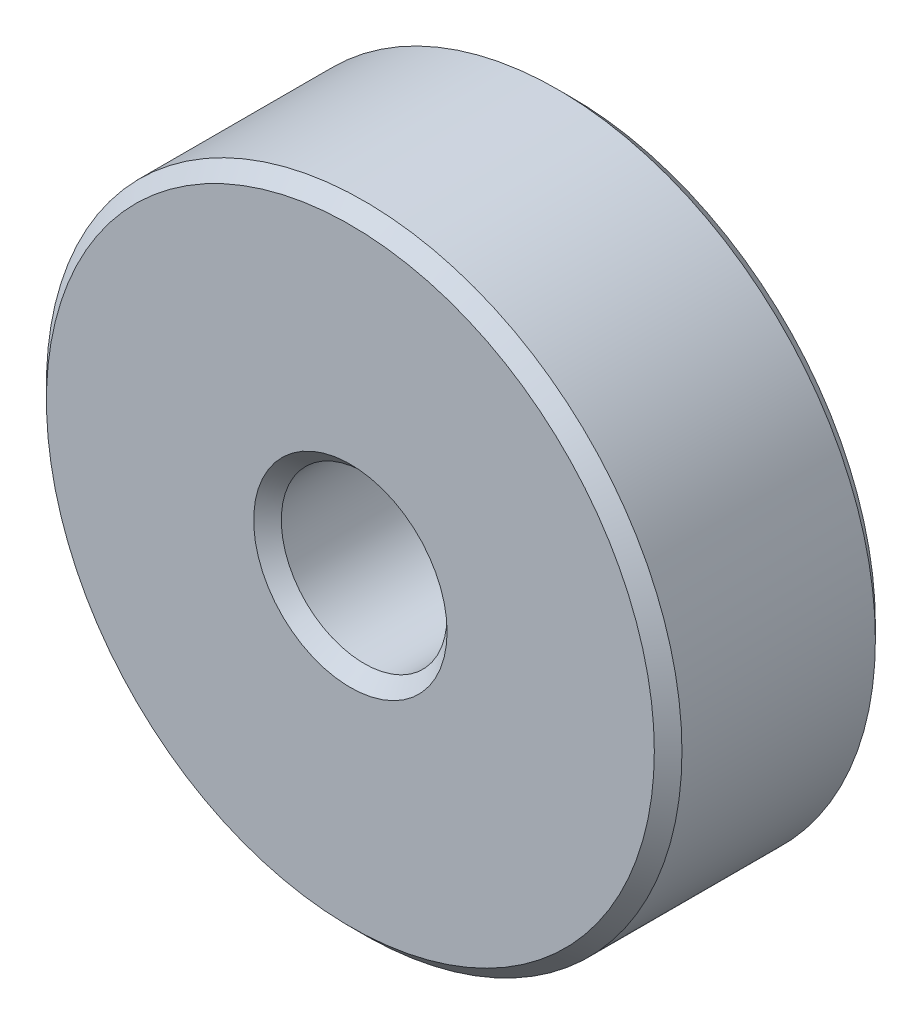
ISO-10303-21;
HEADER;
FILE_DESCRIPTION(('STEP AP214'),'2;1');
FILE_NAME('part.step','',(''),(''),'','','');
FILE_SCHEMA(('AUTOMOTIVE_DESIGN { 1 0 10303 214 1 1 1 1 }'));
ENDSEC;
DATA;
#1=APPLICATION_CONTEXT('core data for automotive mechanical design processes');
#2=APPLICATION_PROTOCOL_DEFINITION('international standard','automotive_design',2000,#1);
#3=PRODUCT_CONTEXT('',#1,'mechanical');
#4=PRODUCT('Part','Part','',(#3));
#5=PRODUCT_RELATED_PRODUCT_CATEGORY('part','',(#4));
#6=PRODUCT_DEFINITION_FORMATION('','',#4);
#7=PRODUCT_DEFINITION_CONTEXT('part definition',#1,'design');
#8=PRODUCT_DEFINITION('design','',#6,#7);
#9=PRODUCT_DEFINITION_SHAPE('','',#8);
#10=(LENGTH_UNIT() NAMED_UNIT(*) SI_UNIT(.MILLI.,.METRE.));
#11=(NAMED_UNIT(*) PLANE_ANGLE_UNIT() SI_UNIT($,.RADIAN.));
#12=(NAMED_UNIT(*) SI_UNIT($,.STERADIAN.) SOLID_ANGLE_UNIT());
#13=UNCERTAINTY_MEASURE_WITH_UNIT(LENGTH_MEASURE(1.E-05),#10,'distance_accuracy_value','');
#14=(GEOMETRIC_REPRESENTATION_CONTEXT(3) GLOBAL_UNCERTAINTY_ASSIGNED_CONTEXT((#13)) GLOBAL_UNIT_ASSIGNED_CONTEXT((#10,
#11,#12)) REPRESENTATION_CONTEXT('',''));
#15=CARTESIAN_POINT('',(0.,0.,0.));
#16=DIRECTION('',(0.,0.,1.));
#17=DIRECTION('',(1.,0.,0.));
#18=AXIS2_PLACEMENT_3D('',#15,#16,#17);
#19=CARTESIAN_POINT('',(0.,0.,2.));
#20=DIRECTION('',(0.,0.,1.));
#21=DIRECTION('',(1.,0.,0.));
#22=AXIS2_PLACEMENT_3D('',#19,#20,#21);
#23=PLANE('',#22);
#24=CARTESIAN_POINT('',(0.,0.,2.));
#25=DIRECTION('',(0.,0.,1.));
#26=DIRECTION('',(1.,0.,0.));
#27=AXIS2_PLACEMENT_3D('',#24,#25,#26);
#28=CIRCLE('',#27,1.75);
#29=CARTESIAN_POINT('',(1.75,0.,2.));
#30=VERTEX_POINT('',#29);
#31=EDGE_CURVE('E42',#30,#30,#28,.F.);
#32=ORIENTED_EDGE('',*,*,#31,.T.);
#33=EDGE_LOOP('',(#32));
#34=FACE_BOUND('',#33,.T.);
#35=CARTESIAN_POINT('',(0.,0.,2.));
#36=DIRECTION('',(0.,0.,1.));
#37=DIRECTION('',(1.,0.,0.));
#38=AXIS2_PLACEMENT_3D('',#35,#36,#37);
#39=CIRCLE('',#38,5.50000000000001);
#40=CARTESIAN_POINT('',(5.50000000000001,0.,2.));
#41=VERTEX_POINT('',#40);
#42=EDGE_CURVE('E46',#41,#41,#39,.T.);
#43=ORIENTED_EDGE('',*,*,#42,.T.);
#44=EDGE_LOOP('',(#43));
#45=FACE_BOUND('',#44,.T.);
#46=ADVANCED_FACE('F31',(#34,#45),#23,.T.);
#47=CARTESIAN_POINT('',(0.,0.,-2.));
#48=DIRECTION('',(0.,0.,1.));
#49=DIRECTION('',(1.,0.,0.));
#50=AXIS2_PLACEMENT_3D('',#47,#48,#49);
#51=PLANE('',#50);
#52=CARTESIAN_POINT('',(0.,0.,-2.));
#53=DIRECTION('',(0.,0.,1.));
#54=DIRECTION('',(1.,0.,0.));
#55=AXIS2_PLACEMENT_3D('',#52,#53,#54);
#56=CIRCLE('',#55,1.75);
#57=CARTESIAN_POINT('',(1.75,0.,-2.));
#58=VERTEX_POINT('',#57);
#59=EDGE_CURVE('E57',#58,#58,#56,.T.);
#60=ORIENTED_EDGE('',*,*,#59,.T.);
#61=EDGE_LOOP('',(#60));
#62=FACE_BOUND('',#61,.T.);
#63=CARTESIAN_POINT('',(0.,0.,-2.));
#64=DIRECTION('',(0.,0.,1.));
#65=DIRECTION('',(1.,0.,0.));
#66=AXIS2_PLACEMENT_3D('',#63,#64,#65);
#67=CIRCLE('',#66,5.5);
#68=CARTESIAN_POINT('',(5.5,0.,-2.));
#69=VERTEX_POINT('',#68);
#70=EDGE_CURVE('E60',#69,#69,#67,.F.);
#71=ORIENTED_EDGE('',*,*,#70,.T.);
#72=EDGE_LOOP('',(#71));
#73=FACE_BOUND('',#72,.T.);
#74=ADVANCED_FACE('F64',(#62,#73),#51,.F.);
#75=CARTESIAN_POINT('',(0.,0.,2.));
#76=DIRECTION('',(0.,0.,-1.));
#77=DIRECTION('',(-1.,0.,0.));
#78=AXIS2_PLACEMENT_3D('',#75,#76,#77);
#79=CYLINDRICAL_SURFACE('',#78,5.75);
#80=CARTESIAN_POINT('',(0.,0.,-1.75));
#81=DIRECTION('',(0.,0.,1.));
#82=DIRECTION('',(1.,0.,0.));
#83=AXIS2_PLACEMENT_3D('',#80,#81,#82);
#84=CIRCLE('',#83,5.75);
#85=CARTESIAN_POINT('',(5.75,0.,-1.75));
#86=VERTEX_POINT('',#85);
#87=EDGE_CURVE('E10',#86,#86,#84,.T.);
#88=ORIENTED_EDGE('',*,*,#87,.T.);
#89=EDGE_LOOP('',(#88));
#90=FACE_BOUND('',#89,.T.);
#91=CARTESIAN_POINT('',(0.,0.,1.75000000000001));
#92=DIRECTION('',(0.,0.,1.));
#93=DIRECTION('',(1.,0.,0.));
#94=AXIS2_PLACEMENT_3D('',#91,#92,#93);
#95=CIRCLE('',#94,5.75);
#96=CARTESIAN_POINT('',(5.75,0.,1.75000000000001));
#97=VERTEX_POINT('',#96);
#98=EDGE_CURVE('E38',#97,#97,#95,.F.);
#99=ORIENTED_EDGE('',*,*,#98,.T.);
#100=EDGE_LOOP('',(#99));
#101=FACE_BOUND('',#100,.T.);
#102=ADVANCED_FACE('F84',(#90,#101),#79,.T.);
#103=CARTESIAN_POINT('',(0.,0.,2.));
#104=DIRECTION('',(0.,0.,-1.));
#105=DIRECTION('',(-1.,0.,0.));
#106=AXIS2_PLACEMENT_3D('',#103,#104,#105);
#107=CYLINDRICAL_SURFACE('',#106,1.5);
#108=CARTESIAN_POINT('',(0.,0.,-1.75));
#109=DIRECTION('',(0.,0.,1.));
#110=DIRECTION('',(1.,0.,0.));
#111=AXIS2_PLACEMENT_3D('',#108,#109,#110);
#112=CIRCLE('',#111,1.5);
#113=CARTESIAN_POINT('',(1.5,0.,-1.75));
#114=VERTEX_POINT('',#113);
#115=EDGE_CURVE('E51',#114,#114,#112,.F.);
#116=ORIENTED_EDGE('',*,*,#115,.T.);
#117=EDGE_LOOP('',(#116));
#118=FACE_BOUND('',#117,.T.);
#119=CARTESIAN_POINT('',(0.,0.,1.75));
#120=DIRECTION('',(0.,0.,1.));
#121=DIRECTION('',(1.,0.,0.));
#122=AXIS2_PLACEMENT_3D('',#119,#120,#121);
#123=CIRCLE('',#122,1.5);
#124=CARTESIAN_POINT('',(1.5,0.,1.75));
#125=VERTEX_POINT('',#124);
#126=EDGE_CURVE('E54',#125,#125,#123,.T.);
#127=ORIENTED_EDGE('',*,*,#126,.T.);
#128=EDGE_LOOP('',(#127));
#129=FACE_BOUND('',#128,.T.);
#130=ADVANCED_FACE('F89',(#118,#129),#107,.F.);
#131=CARTESIAN_POINT('',(0.,0.,-2.));
#132=DIRECTION('',(0.,0.,-1.));
#133=DIRECTION('',(-1.,0.,0.));
#134=AXIS2_PLACEMENT_3D('',#131,#132,#133);
#135=CONICAL_SURFACE('',#134,1.75,0.785398163397449);
#136=ORIENTED_EDGE('',*,*,#115,.F.);
#137=EDGE_LOOP('',(#136));
#138=FACE_BOUND('',#137,.T.);
#139=ORIENTED_EDGE('',*,*,#59,.F.);
#140=EDGE_LOOP('',(#139));
#141=FACE_BOUND('',#140,.T.);
#142=ADVANCED_FACE('F75',(#138,#141),#135,.F.);
#143=CARTESIAN_POINT('',(0.,0.,1.75));
#144=DIRECTION('',(0.,0.,1.));
#145=DIRECTION('',(1.,0.,0.));
#146=AXIS2_PLACEMENT_3D('',#143,#144,#145);
#147=CONICAL_SURFACE('',#146,1.5,0.785398163397452);
#148=ORIENTED_EDGE('',*,*,#31,.F.);
#149=EDGE_LOOP('',(#148));
#150=FACE_BOUND('',#149,.T.);
#151=ORIENTED_EDGE('',*,*,#126,.F.);
#152=EDGE_LOOP('',(#151));
#153=FACE_BOUND('',#152,.T.);
#154=ADVANCED_FACE('F69',(#150,#153),#147,.F.);
#155=CARTESIAN_POINT('',(0.,0.,-1.75));
#156=DIRECTION('',(0.,0.,1.));
#157=DIRECTION('',(1.,0.,0.));
#158=AXIS2_PLACEMENT_3D('',#155,#156,#157);
#159=CONICAL_SURFACE('',#158,5.75,0.785398163397454);
#160=ORIENTED_EDGE('',*,*,#70,.F.);
#161=EDGE_LOOP('',(#160));
#162=FACE_BOUND('',#161,.T.);
#163=ORIENTED_EDGE('',*,*,#87,.F.);
#164=EDGE_LOOP('',(#163));
#165=FACE_BOUND('',#164,.T.);
#166=ADVANCED_FACE('F66',(#162,#165),#159,.T.);
#167=CARTESIAN_POINT('',(0.,0.,2.));
#168=DIRECTION('',(0.,0.,-1.));
#169=DIRECTION('',(-1.,0.,0.));
#170=AXIS2_PLACEMENT_3D('',#167,#168,#169);
#171=CONICAL_SURFACE('',#170,5.50000000000001,0.785398163397452);
#172=ORIENTED_EDGE('',*,*,#98,.F.);
#173=EDGE_LOOP('',(#172));
#174=FACE_BOUND('',#173,.T.);
#175=ORIENTED_EDGE('',*,*,#42,.F.);
#176=EDGE_LOOP('',(#175));
#177=FACE_BOUND('',#176,.T.);
#178=ADVANCED_FACE('F33',(#174,#177),#171,.T.);
#179=CLOSED_SHELL('',(#46,#74,#102,#130,#142,#154,#166,#178));
#180=MANIFOLD_SOLID_BREP('B2',#179);
#181=ADVANCED_BREP_SHAPE_REPRESENTATION('',(#18,#180),#14);
#182=SHAPE_DEFINITION_REPRESENTATION(#9,#181);
ENDSEC;
END-ISO-10303-21;
